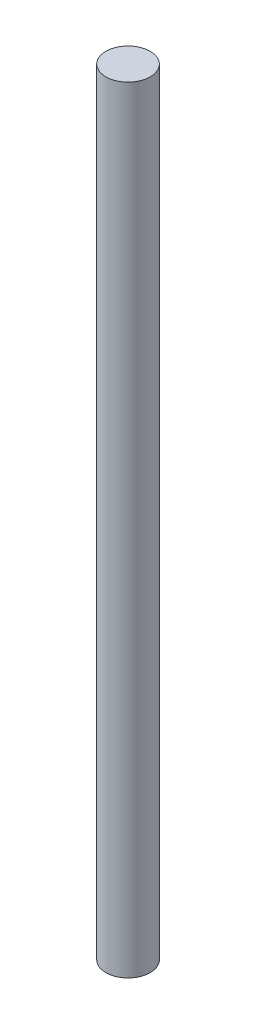
ISO-10303-21;
HEADER;
FILE_DESCRIPTION(('STEP AP214'),'2;1');
FILE_NAME('part.step','',(''),(''),'','','');
FILE_SCHEMA(('AUTOMOTIVE_DESIGN { 1 0 10303 214 1 1 1 1 }'));
ENDSEC;
DATA;
#1=APPLICATION_CONTEXT('core data for automotive mechanical design processes');
#2=APPLICATION_PROTOCOL_DEFINITION('international standard','automotive_design',2000,#1);
#3=PRODUCT_CONTEXT('',#1,'mechanical');
#4=PRODUCT('Part','Part','',(#3));
#5=PRODUCT_RELATED_PRODUCT_CATEGORY('part','',(#4));
#6=PRODUCT_DEFINITION_FORMATION('','',#4);
#7=PRODUCT_DEFINITION_CONTEXT('part definition',#1,'design');
#8=PRODUCT_DEFINITION('design','',#6,#7);
#9=PRODUCT_DEFINITION_SHAPE('','',#8);
#10=(LENGTH_UNIT() NAMED_UNIT(*) SI_UNIT(.MILLI.,.METRE.));
#11=(NAMED_UNIT(*) PLANE_ANGLE_UNIT() SI_UNIT($,.RADIAN.));
#12=(NAMED_UNIT(*) SI_UNIT($,.STERADIAN.) SOLID_ANGLE_UNIT());
#13=UNCERTAINTY_MEASURE_WITH_UNIT(LENGTH_MEASURE(1.E-05),#10,'distance_accuracy_value','');
#14=(GEOMETRIC_REPRESENTATION_CONTEXT(3) GLOBAL_UNCERTAINTY_ASSIGNED_CONTEXT((#13)) GLOBAL_UNIT_ASSIGNED_CONTEXT((#10,
#11,#12)) REPRESENTATION_CONTEXT('',''));
#15=CARTESIAN_POINT('',(0.,0.,0.));
#16=DIRECTION('',(0.,0.,1.));
#17=DIRECTION('',(1.,0.,0.));
#18=AXIS2_PLACEMENT_3D('',#15,#16,#17);
#19=CARTESIAN_POINT('',(0.,35.,0.));
#20=DIRECTION('',(0.,1.,0.));
#21=DIRECTION('',(0.,0.,1.));
#22=AXIS2_PLACEMENT_3D('',#19,#20,#21);
#23=PLANE('',#22);
#24=CARTESIAN_POINT('',(0.,35.,0.));
#25=DIRECTION('',(0.,-1.,0.));
#26=DIRECTION('',(0.,0.,-1.));
#27=AXIS2_PLACEMENT_3D('',#24,#25,#26);
#28=CIRCLE('',#27,2.);
#29=CARTESIAN_POINT('',(0.,35.,-2.));
#30=VERTEX_POINT('',#29);
#31=EDGE_CURVE('E10',#30,#30,#28,.T.);
#32=ORIENTED_EDGE('',*,*,#31,.F.);
#33=EDGE_LOOP('',(#32));
#34=FACE_BOUND('',#33,.T.);
#35=ADVANCED_FACE('F30',(#34),#23,.T.);
#36=CARTESIAN_POINT('',(0.,0.,0.));
#37=DIRECTION('',(0.,-1.,0.));
#38=DIRECTION('',(0.,0.,-1.));
#39=AXIS2_PLACEMENT_3D('',#36,#37,#38);
#40=CYLINDRICAL_SURFACE('',#39,2.);
#41=ORIENTED_EDGE('',*,*,#31,.T.);
#42=EDGE_LOOP('',(#41));
#43=FACE_BOUND('',#42,.T.);
#44=CARTESIAN_POINT('',(0.,-35.,0.));
#45=DIRECTION('',(0.,-1.,0.));
#46=DIRECTION('',(0.,0.,-1.));
#47=AXIS2_PLACEMENT_3D('',#44,#45,#46);
#48=CIRCLE('',#47,2.);
#49=CARTESIAN_POINT('',(0.,-35.,-2.));
#50=VERTEX_POINT('',#49);
#51=EDGE_CURVE('E36',#50,#50,#48,.T.);
#52=ORIENTED_EDGE('',*,*,#51,.F.);
#53=EDGE_LOOP('',(#52));
#54=FACE_BOUND('',#53,.T.);
#55=ADVANCED_FACE('F44',(#43,#54),#40,.T.);
#56=CARTESIAN_POINT('',(0.,-35.,0.));
#57=DIRECTION('',(0.,-1.,0.));
#58=DIRECTION('',(0.,0.,-1.));
#59=AXIS2_PLACEMENT_3D('',#56,#57,#58);
#60=PLANE('',#59);
#61=ORIENTED_EDGE('',*,*,#51,.T.);
#62=EDGE_LOOP('',(#61));
#63=FACE_BOUND('',#62,.T.);
#64=ADVANCED_FACE('F42',(#63),#60,.T.);
#65=CLOSED_SHELL('',(#35,#55,#64));
#66=MANIFOLD_SOLID_BREP('B2',#65);
#67=ADVANCED_BREP_SHAPE_REPRESENTATION('',(#18,#66),#14);
#68=SHAPE_DEFINITION_REPRESENTATION(#9,#67);
ENDSEC;
END-ISO-10303-21;
